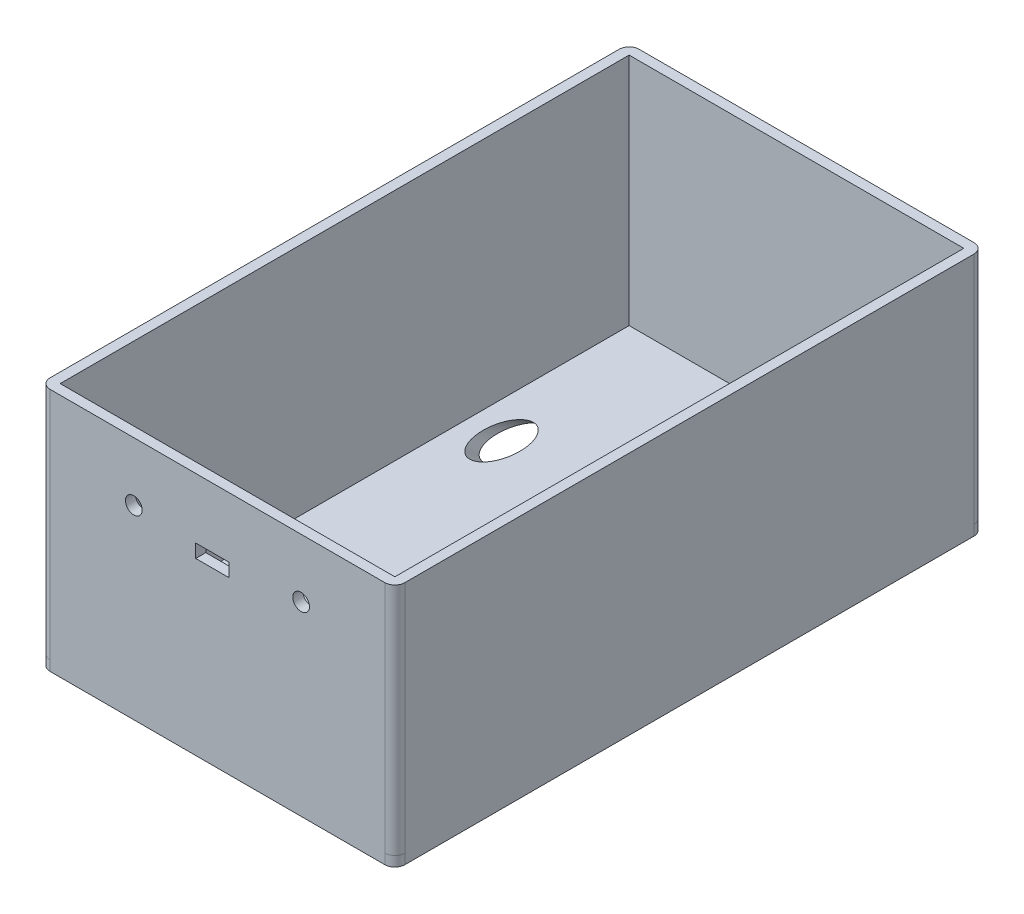
ISO-10303-21;
HEADER;
FILE_DESCRIPTION(('STEP AP214'),'2;1');
FILE_NAME('part.step','',(''),(''),'','','');
FILE_SCHEMA(('AUTOMOTIVE_DESIGN { 1 0 10303 214 1 1 1 1 }'));
ENDSEC;
DATA;
#1=APPLICATION_CONTEXT('core data for automotive mechanical design processes');
#2=APPLICATION_PROTOCOL_DEFINITION('international standard','automotive_design',2000,#1);
#3=PRODUCT_CONTEXT('',#1,'mechanical');
#4=PRODUCT('Part','Part','',(#3));
#5=PRODUCT_RELATED_PRODUCT_CATEGORY('part','',(#4));
#6=PRODUCT_DEFINITION_FORMATION('','',#4);
#7=PRODUCT_DEFINITION_CONTEXT('part definition',#1,'design');
#8=PRODUCT_DEFINITION('design','',#6,#7);
#9=PRODUCT_DEFINITION_SHAPE('','',#8);
#10=(LENGTH_UNIT() NAMED_UNIT(*) SI_UNIT(.MILLI.,.METRE.));
#11=(NAMED_UNIT(*) PLANE_ANGLE_UNIT() SI_UNIT($,.RADIAN.));
#12=(NAMED_UNIT(*) SI_UNIT($,.STERADIAN.) SOLID_ANGLE_UNIT());
#13=UNCERTAINTY_MEASURE_WITH_UNIT(LENGTH_MEASURE(1.E-05),#10,'distance_accuracy_value','');
#14=(GEOMETRIC_REPRESENTATION_CONTEXT(3) GLOBAL_UNCERTAINTY_ASSIGNED_CONTEXT((#13)) GLOBAL_UNIT_ASSIGNED_CONTEXT((#10,
#11,#12)) REPRESENTATION_CONTEXT('',''));
#15=CARTESIAN_POINT('',(0.,0.,0.));
#16=DIRECTION('',(0.,0.,1.));
#17=DIRECTION('',(1.,0.,0.));
#18=AXIS2_PLACEMENT_3D('',#15,#16,#17);
#19=CARTESIAN_POINT('',(0.,70.,0.));
#20=DIRECTION('',(0.,-1.,0.));
#21=DIRECTION('',(0.,0.,-1.));
#22=AXIS2_PLACEMENT_3D('',#19,#20,#21);
#23=PLANE('',#22);
#24=DIRECTION('',(0.,0.,1.));
#25=VECTOR('',#24,1.);
#26=CARTESIAN_POINT('',(-53.,70.,-88.));
#27=LINE('',#26,#25);
#28=CARTESIAN_POINT('',(-53.,70.,-85.));
#29=VERTEX_POINT('',#28);
#30=CARTESIAN_POINT('',(-53.,70.,85.));
#31=VERTEX_POINT('',#30);
#32=EDGE_CURVE('E435',#29,#31,#27,.T.);
#33=ORIENTED_EDGE('',*,*,#32,.T.);
#34=CARTESIAN_POINT('',(-50.,70.,85.));
#35=DIRECTION('',(0.,-1.,0.));
#36=DIRECTION('',(0.,0.,-1.));
#37=AXIS2_PLACEMENT_3D('',#34,#35,#36);
#38=CIRCLE('',#37,3.);
#39=CARTESIAN_POINT('',(-50.,70.,88.));
#40=VERTEX_POINT('',#39);
#41=EDGE_CURVE('E486',#31,#40,#38,.F.);
#42=ORIENTED_EDGE('',*,*,#41,.T.);
#43=DIRECTION('',(1.,0.,0.));
#44=VECTOR('',#43,1.);
#45=CARTESIAN_POINT('',(53.,70.,88.));
#46=LINE('',#45,#44);
#47=CARTESIAN_POINT('',(50.,70.,88.));
#48=VERTEX_POINT('',#47);
#49=EDGE_CURVE('E439',#40,#48,#46,.T.);
#50=ORIENTED_EDGE('',*,*,#49,.T.);
#51=CARTESIAN_POINT('',(50.,70.,85.));
#52=DIRECTION('',(0.,-1.,0.));
#53=DIRECTION('',(0.,0.,-1.));
#54=AXIS2_PLACEMENT_3D('',#51,#52,#53);
#55=CIRCLE('',#54,3.);
#56=CARTESIAN_POINT('',(53.,70.,85.));
#57=VERTEX_POINT('',#56);
#58=EDGE_CURVE('E477',#48,#57,#55,.F.);
#59=ORIENTED_EDGE('',*,*,#58,.T.);
#60=DIRECTION('',(0.,0.,-1.));
#61=VECTOR('',#60,1.);
#62=CARTESIAN_POINT('',(53.,70.,-88.));
#63=LINE('',#62,#61);
#64=CARTESIAN_POINT('',(53.,70.,-85.));
#65=VERTEX_POINT('',#64);
#66=EDGE_CURVE('E443',#57,#65,#63,.T.);
#67=ORIENTED_EDGE('',*,*,#66,.T.);
#68=CARTESIAN_POINT('',(50.,70.,-85.));
#69=DIRECTION('',(0.,-1.,0.));
#70=DIRECTION('',(0.,0.,-1.));
#71=AXIS2_PLACEMENT_3D('',#68,#69,#70);
#72=CIRCLE('',#71,3.);
#73=CARTESIAN_POINT('',(50.,70.,-88.));
#74=VERTEX_POINT('',#73);
#75=EDGE_CURVE('E480',#65,#74,#72,.F.);
#76=ORIENTED_EDGE('',*,*,#75,.T.);
#77=DIRECTION('',(-1.,0.,0.));
#78=VECTOR('',#77,1.);
#79=CARTESIAN_POINT('',(53.,70.,-88.));
#80=LINE('',#79,#78);
#81=CARTESIAN_POINT('',(-50.,70.,-88.));
#82=VERTEX_POINT('',#81);
#83=EDGE_CURVE('E447',#74,#82,#80,.T.);
#84=ORIENTED_EDGE('',*,*,#83,.T.);
#85=CARTESIAN_POINT('',(-50.,70.,-85.));
#86=DIRECTION('',(0.,-1.,0.));
#87=DIRECTION('',(0.,0.,-1.));
#88=AXIS2_PLACEMENT_3D('',#85,#86,#87);
#89=CIRCLE('',#88,3.);
#90=EDGE_CURVE('E483',#82,#29,#89,.F.);
#91=ORIENTED_EDGE('',*,*,#90,.T.);
#92=EDGE_LOOP('',(#33,#42,#50,#59,#67,#76,#84,#91));
#93=FACE_BOUND('',#92,.T.);
#94=DIRECTION('',(0.,0.,1.));
#95=VECTOR('',#94,1.);
#96=CARTESIAN_POINT('',(-50.,70.,-85.));
#97=LINE('',#96,#95);
#98=CARTESIAN_POINT('',(-50.,70.,-85.));
#99=VERTEX_POINT('',#98);
#100=CARTESIAN_POINT('',(-50.,70.,85.));
#101=VERTEX_POINT('',#100);
#102=EDGE_CURVE('E392',#99,#101,#97,.T.);
#103=ORIENTED_EDGE('',*,*,#102,.F.);
#104=DIRECTION('',(-1.,0.,0.));
#105=VECTOR('',#104,1.);
#106=CARTESIAN_POINT('',(50.,70.,-85.));
#107=LINE('',#106,#105);
#108=CARTESIAN_POINT('',(50.,70.,-85.));
#109=VERTEX_POINT('',#108);
#110=EDGE_CURVE('E403',#109,#99,#107,.T.);
#111=ORIENTED_EDGE('',*,*,#110,.F.);
#112=DIRECTION('',(0.,0.,-1.));
#113=VECTOR('',#112,1.);
#114=CARTESIAN_POINT('',(50.,70.,-85.));
#115=LINE('',#114,#113);
#116=CARTESIAN_POINT('',(50.,70.,85.));
#117=VERTEX_POINT('',#116);
#118=EDGE_CURVE('E399',#117,#109,#115,.T.);
#119=ORIENTED_EDGE('',*,*,#118,.F.);
#120=DIRECTION('',(1.,0.,0.));
#121=VECTOR('',#120,1.);
#122=CARTESIAN_POINT('',(50.,70.,85.));
#123=LINE('',#122,#121);
#124=EDGE_CURVE('E395',#101,#117,#123,.T.);
#125=ORIENTED_EDGE('',*,*,#124,.F.);
#126=EDGE_LOOP('',(#103,#111,#119,#125));
#127=FACE_BOUND('',#126,.T.);
#128=ADVANCED_FACE('F39',(#93,#127),#23,.F.);
#129=CARTESIAN_POINT('',(-53.,70.,-88.));
#130=DIRECTION('',(1.,0.,0.));
#131=DIRECTION('',(0.,0.,-1.));
#132=AXIS2_PLACEMENT_3D('',#129,#130,#131);
#133=PLANE('',#132);
#134=DIRECTION('',(0.,-1.,0.));
#135=VECTOR('',#134,1.);
#136=CARTESIAN_POINT('',(-53.,70.,-85.));
#137=LINE('',#136,#135);
#138=CARTESIAN_POINT('',(-53.,0.,-85.));
#139=VERTEX_POINT('',#138);
#140=EDGE_CURVE('E470',#29,#139,#137,.T.);
#141=ORIENTED_EDGE('',*,*,#140,.T.);
#142=DIRECTION('',(0.,1.,0.));
#143=VECTOR('',#142,1.);
#144=CARTESIAN_POINT('',(-53.,70.,-85.));
#145=LINE('',#144,#143);
#146=CARTESIAN_POINT('',(-53.,-3.,-85.));
#147=VERTEX_POINT('',#146);
#148=EDGE_CURVE('E11',#139,#147,#145,.F.);
#149=ORIENTED_EDGE('',*,*,#148,.T.);
#150=DIRECTION('',(0.,0.,-1.));
#151=VECTOR('',#150,1.);
#152=CARTESIAN_POINT('',(-53.,-3.,88.));
#153=LINE('',#152,#151);
#154=CARTESIAN_POINT('',(-53.,-3.,85.));
#155=VERTEX_POINT('',#154);
#156=EDGE_CURVE('E372',#155,#147,#153,.T.);
#157=ORIENTED_EDGE('',*,*,#156,.F.);
#158=DIRECTION('',(0.,1.,0.));
#159=VECTOR('',#158,1.);
#160=CARTESIAN_POINT('',(-53.,70.,85.));
#161=LINE('',#160,#159);
#162=CARTESIAN_POINT('',(-53.,0.,85.));
#163=VERTEX_POINT('',#162);
#164=EDGE_CURVE('E49',#155,#163,#161,.T.);
#165=ORIENTED_EDGE('',*,*,#164,.T.);
#166=DIRECTION('',(0.,-1.,0.));
#167=VECTOR('',#166,1.);
#168=CARTESIAN_POINT('',(-53.,70.,85.));
#169=LINE('',#168,#167);
#170=EDGE_CURVE('E474',#163,#31,#169,.F.);
#171=ORIENTED_EDGE('',*,*,#170,.T.);
#172=ORIENTED_EDGE('',*,*,#32,.F.);
#173=EDGE_LOOP('',(#141,#149,#157,#165,#171,#172));
#174=FACE_BOUND('',#173,.T.);
#175=ADVANCED_FACE('F542',(#174),#133,.F.);
#176=CARTESIAN_POINT('',(53.,70.,88.));
#177=DIRECTION('',(0.,0.,-1.));
#178=DIRECTION('',(-1.,0.,0.));
#179=AXIS2_PLACEMENT_3D('',#176,#177,#178);
#180=PLANE('',#179);
#181=DIRECTION('',(0.,-1.,0.));
#182=VECTOR('',#181,1.);
#183=CARTESIAN_POINT('',(3.5,57.,88.));
#184=LINE('',#183,#182);
#185=CARTESIAN_POINT('',(3.5,52.,88.));
#186=VERTEX_POINT('',#185);
#187=CARTESIAN_POINT('',(3.5,48.,88.));
#188=VERTEX_POINT('',#187);
#189=EDGE_CURVE('E237',#186,#188,#184,.T.);
#190=ORIENTED_EDGE('',*,*,#189,.T.);
#191=DIRECTION('',(-1.,0.,0.));
#192=VECTOR('',#191,1.);
#193=CARTESIAN_POINT('',(6.5,48.,88.));
#194=LINE('',#193,#192);
#195=CARTESIAN_POINT('',(-6.5,48.,88.));
#196=VERTEX_POINT('',#195);
#197=EDGE_CURVE('E244',#188,#196,#194,.T.);
#198=ORIENTED_EDGE('',*,*,#197,.T.);
#199=DIRECTION('',(0.,1.,0.));
#200=VECTOR('',#199,1.);
#201=CARTESIAN_POINT('',(-6.5,48.,88.));
#202=LINE('',#201,#200);
#203=CARTESIAN_POINT('',(-6.5,52.,88.));
#204=VERTEX_POINT('',#203);
#205=EDGE_CURVE('E254',#196,#204,#202,.T.);
#206=ORIENTED_EDGE('',*,*,#205,.T.);
#207=DIRECTION('',(1.,0.,0.));
#208=VECTOR('',#207,1.);
#209=CARTESIAN_POINT('',(-6.5,52.,88.));
#210=LINE('',#209,#208);
#211=EDGE_CURVE('E246',#204,#186,#210,.T.);
#212=ORIENTED_EDGE('',*,*,#211,.T.);
#213=EDGE_LOOP('',(#190,#198,#206,#212));
#214=FACE_BOUND('',#213,.T.);
#215=CARTESIAN_POINT('',(25.,52.5,88.));
#216=DIRECTION('',(0.,0.,-1.));
#217=DIRECTION('',(-1.,0.,0.));
#218=AXIS2_PLACEMENT_3D('',#215,#216,#217);
#219=CIRCLE('',#218,2.5);
#220=CARTESIAN_POINT('',(22.5,52.5,88.));
#221=VERTEX_POINT('',#220);
#222=EDGE_CURVE('E268',#221,#221,#219,.T.);
#223=ORIENTED_EDGE('',*,*,#222,.T.);
#224=EDGE_LOOP('',(#223));
#225=FACE_BOUND('',#224,.T.);
#226=CARTESIAN_POINT('',(-25.,52.5,88.));
#227=DIRECTION('',(0.,0.,-1.));
#228=DIRECTION('',(-1.,0.,0.));
#229=AXIS2_PLACEMENT_3D('',#226,#227,#228);
#230=CIRCLE('',#229,2.5);
#231=CARTESIAN_POINT('',(-27.5,52.5,88.));
#232=VERTEX_POINT('',#231);
#233=EDGE_CURVE('E276',#232,#232,#230,.T.);
#234=ORIENTED_EDGE('',*,*,#233,.T.);
#235=EDGE_LOOP('',(#234));
#236=FACE_BOUND('',#235,.T.);
#237=DIRECTION('',(-1.,0.,0.));
#238=VECTOR('',#237,1.);
#239=CARTESIAN_POINT('',(53.,-3.,88.));
#240=LINE('',#239,#238);
#241=CARTESIAN_POINT('',(50.,-3.,88.));
#242=VERTEX_POINT('',#241);
#243=CARTESIAN_POINT('',(-50.,-3.,88.));
#244=VERTEX_POINT('',#243);
#245=EDGE_CURVE('E387',#242,#244,#240,.T.);
#246=ORIENTED_EDGE('',*,*,#245,.F.);
#247=DIRECTION('',(0.,1.,0.));
#248=VECTOR('',#247,1.);
#249=CARTESIAN_POINT('',(50.,70.,88.));
#250=LINE('',#249,#248);
#251=CARTESIAN_POINT('',(50.,0.,88.));
#252=VERTEX_POINT('',#251);
#253=EDGE_CURVE('E506',#242,#252,#250,.T.);
#254=ORIENTED_EDGE('',*,*,#253,.T.);
#255=DIRECTION('',(0.,-1.,0.));
#256=VECTOR('',#255,1.);
#257=CARTESIAN_POINT('',(50.,70.,88.));
#258=LINE('',#257,#256);
#259=EDGE_CURVE('E451',#252,#48,#258,.F.);
#260=ORIENTED_EDGE('',*,*,#259,.T.);
#261=ORIENTED_EDGE('',*,*,#49,.F.);
#262=DIRECTION('',(0.,-1.,0.));
#263=VECTOR('',#262,1.);
#264=CARTESIAN_POINT('',(-50.,70.,88.));
#265=LINE('',#264,#263);
#266=CARTESIAN_POINT('',(-50.,0.,88.));
#267=VERTEX_POINT('',#266);
#268=EDGE_CURVE('E454',#40,#267,#265,.T.);
#269=ORIENTED_EDGE('',*,*,#268,.T.);
#270=DIRECTION('',(0.,1.,0.));
#271=VECTOR('',#270,1.);
#272=CARTESIAN_POINT('',(-50.,70.,88.));
#273=LINE('',#272,#271);
#274=EDGE_CURVE('E503',#267,#244,#273,.F.);
#275=ORIENTED_EDGE('',*,*,#274,.T.);
#276=EDGE_LOOP('',(#246,#254,#260,#261,#269,#275));
#277=FACE_BOUND('',#276,.T.);
#278=ADVANCED_FACE('F556',(#214,#225,#236,#277),#180,.F.);
#279=CARTESIAN_POINT('',(53.,70.,-88.));
#280=DIRECTION('',(-1.,0.,0.));
#281=DIRECTION('',(0.,0.,1.));
#282=AXIS2_PLACEMENT_3D('',#279,#280,#281);
#283=PLANE('',#282);
#284=DIRECTION('',(0.,-1.,0.));
#285=VECTOR('',#284,1.);
#286=CARTESIAN_POINT('',(53.,70.,85.));
#287=LINE('',#286,#285);
#288=CARTESIAN_POINT('',(53.,0.,85.));
#289=VERTEX_POINT('',#288);
#290=EDGE_CURVE('E496',#57,#289,#287,.T.);
#291=ORIENTED_EDGE('',*,*,#290,.T.);
#292=DIRECTION('',(0.,1.,0.));
#293=VECTOR('',#292,1.);
#294=CARTESIAN_POINT('',(53.,70.,85.));
#295=LINE('',#294,#293);
#296=CARTESIAN_POINT('',(53.,-3.,85.));
#297=VERTEX_POINT('',#296);
#298=EDGE_CURVE('E514',#289,#297,#295,.F.);
#299=ORIENTED_EDGE('',*,*,#298,.T.);
#300=DIRECTION('',(0.,0.,1.));
#301=VECTOR('',#300,1.);
#302=CARTESIAN_POINT('',(53.,-3.,88.));
#303=LINE('',#302,#301);
#304=CARTESIAN_POINT('',(53.,-3.,-85.));
#305=VERTEX_POINT('',#304);
#306=EDGE_CURVE('E383',#305,#297,#303,.T.);
#307=ORIENTED_EDGE('',*,*,#306,.F.);
#308=DIRECTION('',(0.,1.,0.));
#309=VECTOR('',#308,1.);
#310=CARTESIAN_POINT('',(53.,70.,-85.));
#311=LINE('',#310,#309);
#312=CARTESIAN_POINT('',(53.,0.,-85.));
#313=VERTEX_POINT('',#312);
#314=EDGE_CURVE('E510',#305,#313,#311,.T.);
#315=ORIENTED_EDGE('',*,*,#314,.T.);
#316=DIRECTION('',(0.,-1.,0.));
#317=VECTOR('',#316,1.);
#318=CARTESIAN_POINT('',(53.,70.,-85.));
#319=LINE('',#318,#317);
#320=EDGE_CURVE('E500',#313,#65,#319,.F.);
#321=ORIENTED_EDGE('',*,*,#320,.T.);
#322=ORIENTED_EDGE('',*,*,#66,.F.);
#323=EDGE_LOOP('',(#291,#299,#307,#315,#321,#322));
#324=FACE_BOUND('',#323,.T.);
#325=ADVANCED_FACE('F566',(#324),#283,.F.);
#326=CARTESIAN_POINT('',(53.,70.,-88.));
#327=DIRECTION('',(0.,0.,1.));
#328=DIRECTION('',(1.,0.,0.));
#329=AXIS2_PLACEMENT_3D('',#326,#327,#328);
#330=PLANE('',#329);
#331=DIRECTION('',(0.,-1.,0.));
#332=VECTOR('',#331,1.);
#333=CARTESIAN_POINT('',(50.,70.,-88.));
#334=LINE('',#333,#332);
#335=CARTESIAN_POINT('',(50.,0.,-88.));
#336=VERTEX_POINT('',#335);
#337=EDGE_CURVE('E489',#74,#336,#334,.T.);
#338=ORIENTED_EDGE('',*,*,#337,.T.);
#339=DIRECTION('',(0.,1.,0.));
#340=VECTOR('',#339,1.);
#341=CARTESIAN_POINT('',(50.,70.,-88.));
#342=LINE('',#341,#340);
#343=CARTESIAN_POINT('',(50.,-3.,-88.));
#344=VERTEX_POINT('',#343);
#345=EDGE_CURVE('E533',#336,#344,#342,.F.);
#346=ORIENTED_EDGE('',*,*,#345,.T.);
#347=DIRECTION('',(1.,0.,0.));
#348=VECTOR('',#347,1.);
#349=CARTESIAN_POINT('',(53.,-3.,-88.));
#350=LINE('',#349,#348);
#351=CARTESIAN_POINT('',(-50.,-3.,-88.));
#352=VERTEX_POINT('',#351);
#353=EDGE_CURVE('E379',#352,#344,#350,.T.);
#354=ORIENTED_EDGE('',*,*,#353,.F.);
#355=DIRECTION('',(0.,1.,0.));
#356=VECTOR('',#355,1.);
#357=CARTESIAN_POINT('',(-50.,70.,-88.));
#358=LINE('',#357,#356);
#359=CARTESIAN_POINT('',(-50.,0.,-88.));
#360=VERTEX_POINT('',#359);
#361=EDGE_CURVE('E529',#352,#360,#358,.T.);
#362=ORIENTED_EDGE('',*,*,#361,.T.);
#363=DIRECTION('',(0.,-1.,0.));
#364=VECTOR('',#363,1.);
#365=CARTESIAN_POINT('',(-50.,70.,-88.));
#366=LINE('',#365,#364);
#367=EDGE_CURVE('E493',#360,#82,#366,.F.);
#368=ORIENTED_EDGE('',*,*,#367,.T.);
#369=ORIENTED_EDGE('',*,*,#83,.F.);
#370=EDGE_LOOP('',(#338,#346,#354,#362,#368,#369));
#371=FACE_BOUND('',#370,.T.);
#372=ADVANCED_FACE('F577',(#371),#330,.F.);
#373=CARTESIAN_POINT('',(-50.,70.,-85.));
#374=DIRECTION('',(1.,0.,0.));
#375=DIRECTION('',(0.,0.,-1.));
#376=AXIS2_PLACEMENT_3D('',#373,#374,#375);
#377=PLANE('',#376);
#378=DIRECTION('',(0.,0.,1.));
#379=VECTOR('',#378,1.);
#380=CARTESIAN_POINT('',(-50.,0.,-85.));
#381=LINE('',#380,#379);
#382=CARTESIAN_POINT('',(-50.,0.,-85.));
#383=VERTEX_POINT('',#382);
#384=CARTESIAN_POINT('',(-50.,0.,85.));
#385=VERTEX_POINT('',#384);
#386=EDGE_CURVE('E391',#383,#385,#381,.T.);
#387=ORIENTED_EDGE('',*,*,#386,.F.);
#388=DIRECTION('',(0.,-1.,0.));
#389=VECTOR('',#388,1.);
#390=CARTESIAN_POINT('',(-50.,70.,-85.));
#391=LINE('',#390,#389);
#392=EDGE_CURVE('E406',#99,#383,#391,.T.);
#393=ORIENTED_EDGE('',*,*,#392,.F.);
#394=ORIENTED_EDGE('',*,*,#102,.T.);
#395=DIRECTION('',(0.,-1.,0.));
#396=VECTOR('',#395,1.);
#397=CARTESIAN_POINT('',(-50.,70.,85.));
#398=LINE('',#397,#396);
#399=EDGE_CURVE('E431',#101,#385,#398,.T.);
#400=ORIENTED_EDGE('',*,*,#399,.T.);
#401=EDGE_LOOP('',(#387,#393,#394,#400));
#402=FACE_BOUND('',#401,.T.);
#403=ADVANCED_FACE('F614',(#402),#377,.T.);
#404=CARTESIAN_POINT('',(50.,70.,85.));
#405=DIRECTION('',(0.,0.,-1.));
#406=DIRECTION('',(-1.,0.,0.));
#407=AXIS2_PLACEMENT_3D('',#404,#405,#406);
#408=PLANE('',#407);
#409=DIRECTION('',(-1.,0.,0.));
#410=VECTOR('',#409,1.);
#411=CARTESIAN_POINT('',(6.5,48.,85.));
#412=LINE('',#411,#410);
#413=CARTESIAN_POINT('',(3.5,48.,85.));
#414=VERTEX_POINT('',#413);
#415=CARTESIAN_POINT('',(-6.5,48.,85.));
#416=VERTEX_POINT('',#415);
#417=EDGE_CURVE('E242',#414,#416,#412,.T.);
#418=ORIENTED_EDGE('',*,*,#417,.F.);
#419=DIRECTION('',(0.,-1.,0.));
#420=VECTOR('',#419,1.);
#421=CARTESIAN_POINT('',(3.5,57.,85.));
#422=LINE('',#421,#420);
#423=CARTESIAN_POINT('',(3.5,52.,85.));
#424=VERTEX_POINT('',#423);
#425=EDGE_CURVE('E225',#424,#414,#422,.T.);
#426=ORIENTED_EDGE('',*,*,#425,.F.);
#427=DIRECTION('',(1.,0.,0.));
#428=VECTOR('',#427,1.);
#429=CARTESIAN_POINT('',(-6.5,52.,85.));
#430=LINE('',#429,#428);
#431=CARTESIAN_POINT('',(-6.5,52.,85.));
#432=VERTEX_POINT('',#431);
#433=EDGE_CURVE('E949',#432,#424,#430,.T.);
#434=ORIENTED_EDGE('',*,*,#433,.F.);
#435=DIRECTION('',(0.,1.,0.));
#436=VECTOR('',#435,1.);
#437=CARTESIAN_POINT('',(-6.5,48.,85.));
#438=LINE('',#437,#436);
#439=EDGE_CURVE('E252',#416,#432,#438,.T.);
#440=ORIENTED_EDGE('',*,*,#439,.F.);
#441=EDGE_LOOP('',(#418,#426,#434,#440));
#442=FACE_BOUND('',#441,.T.);
#443=CARTESIAN_POINT('',(25.,52.5,85.));
#444=DIRECTION('',(0.,0.,-1.));
#445=DIRECTION('',(-1.,0.,0.));
#446=AXIS2_PLACEMENT_3D('',#443,#444,#445);
#447=CIRCLE('',#446,2.5);
#448=CARTESIAN_POINT('',(22.5,52.5,85.));
#449=VERTEX_POINT('',#448);
#450=EDGE_CURVE('E272',#449,#449,#447,.T.);
#451=ORIENTED_EDGE('',*,*,#450,.F.);
#452=EDGE_LOOP('',(#451));
#453=FACE_BOUND('',#452,.T.);
#454=CARTESIAN_POINT('',(-25.,52.5,85.));
#455=DIRECTION('',(0.,0.,-1.));
#456=DIRECTION('',(-1.,0.,0.));
#457=AXIS2_PLACEMENT_3D('',#454,#455,#456);
#458=CIRCLE('',#457,2.5);
#459=CARTESIAN_POINT('',(-27.5,52.5,85.));
#460=VERTEX_POINT('',#459);
#461=EDGE_CURVE('E267',#460,#460,#458,.T.);
#462=ORIENTED_EDGE('',*,*,#461,.F.);
#463=EDGE_LOOP('',(#462));
#464=FACE_BOUND('',#463,.T.);
#465=DIRECTION('',(1.,0.,0.));
#466=VECTOR('',#465,1.);
#467=CARTESIAN_POINT('',(50.,0.,85.));
#468=LINE('',#467,#466);
#469=CARTESIAN_POINT('',(50.,0.,85.));
#470=VERTEX_POINT('',#469);
#471=EDGE_CURVE('E410',#385,#470,#468,.T.);
#472=ORIENTED_EDGE('',*,*,#471,.F.);
#473=ORIENTED_EDGE('',*,*,#399,.F.);
#474=ORIENTED_EDGE('',*,*,#124,.T.);
#475=DIRECTION('',(0.,-1.,0.));
#476=VECTOR('',#475,1.);
#477=CARTESIAN_POINT('',(50.,70.,85.));
#478=LINE('',#477,#476);
#479=EDGE_CURVE('E428',#117,#470,#478,.T.);
#480=ORIENTED_EDGE('',*,*,#479,.T.);
#481=EDGE_LOOP('',(#472,#473,#474,#480));
#482=FACE_BOUND('',#481,.T.);
#483=ADVANCED_FACE('F249',(#442,#453,#464,#482),#408,.T.);
#484=CARTESIAN_POINT('',(50.,70.,-85.));
#485=DIRECTION('',(-1.,0.,0.));
#486=DIRECTION('',(0.,0.,1.));
#487=AXIS2_PLACEMENT_3D('',#484,#485,#486);
#488=PLANE('',#487);
#489=DIRECTION('',(0.,0.,-1.));
#490=VECTOR('',#489,1.);
#491=CARTESIAN_POINT('',(50.,0.,-85.));
#492=LINE('',#491,#490);
#493=CARTESIAN_POINT('',(50.,0.,-85.));
#494=VERTEX_POINT('',#493);
#495=EDGE_CURVE('E414',#470,#494,#492,.T.);
#496=ORIENTED_EDGE('',*,*,#495,.F.);
#497=ORIENTED_EDGE('',*,*,#479,.F.);
#498=ORIENTED_EDGE('',*,*,#118,.T.);
#499=DIRECTION('',(0.,-1.,0.));
#500=VECTOR('',#499,1.);
#501=CARTESIAN_POINT('',(50.,70.,-85.));
#502=LINE('',#501,#500);
#503=EDGE_CURVE('E424',#109,#494,#502,.T.);
#504=ORIENTED_EDGE('',*,*,#503,.T.);
#505=EDGE_LOOP('',(#496,#497,#498,#504));
#506=FACE_BOUND('',#505,.T.);
#507=ADVANCED_FACE('F812',(#506),#488,.T.);
#508=CARTESIAN_POINT('',(50.,70.,-85.));
#509=DIRECTION('',(0.,0.,1.));
#510=DIRECTION('',(1.,0.,0.));
#511=AXIS2_PLACEMENT_3D('',#508,#509,#510);
#512=PLANE('',#511);
#513=DIRECTION('',(-1.,0.,0.));
#514=VECTOR('',#513,1.);
#515=CARTESIAN_POINT('',(50.,0.,-85.));
#516=LINE('',#515,#514);
#517=EDGE_CURVE('E396',#494,#383,#516,.T.);
#518=ORIENTED_EDGE('',*,*,#517,.F.);
#519=ORIENTED_EDGE('',*,*,#503,.F.);
#520=ORIENTED_EDGE('',*,*,#110,.T.);
#521=ORIENTED_EDGE('',*,*,#392,.T.);
#522=EDGE_LOOP('',(#518,#519,#520,#521));
#523=FACE_BOUND('',#522,.T.);
#524=ADVANCED_FACE('F625',(#523),#512,.T.);
#525=CARTESIAN_POINT('',(-50.,70.,85.));
#526=DIRECTION('',(0.,-1.,0.));
#527=DIRECTION('',(0.,0.,-1.));
#528=AXIS2_PLACEMENT_3D('',#525,#526,#527);
#529=CYLINDRICAL_SURFACE('',#528,3.);
#530=ORIENTED_EDGE('',*,*,#41,.F.);
#531=ORIENTED_EDGE('',*,*,#170,.F.);
#532=CARTESIAN_POINT('',(-50.,0.,85.));
#533=DIRECTION('',(0.,-1.,0.));
#534=DIRECTION('',(0.,0.,-1.));
#535=AXIS2_PLACEMENT_3D('',#532,#533,#534);
#536=CIRCLE('',#535,3.);
#537=EDGE_CURVE('E467',#267,#163,#536,.T.);
#538=ORIENTED_EDGE('',*,*,#537,.F.);
#539=ORIENTED_EDGE('',*,*,#268,.F.);
#540=EDGE_LOOP('',(#530,#531,#538,#539));
#541=FACE_BOUND('',#540,.T.);
#542=ADVANCED_FACE('F548',(#541),#529,.T.);
#543=CARTESIAN_POINT('',(-50.,70.,-85.));
#544=DIRECTION('',(0.,-1.,0.));
#545=DIRECTION('',(0.,0.,-1.));
#546=AXIS2_PLACEMENT_3D('',#543,#544,#545);
#547=CYLINDRICAL_SURFACE('',#546,3.);
#548=ORIENTED_EDGE('',*,*,#90,.F.);
#549=ORIENTED_EDGE('',*,*,#367,.F.);
#550=CARTESIAN_POINT('',(-50.,0.,-85.));
#551=DIRECTION('',(0.,-1.,0.));
#552=DIRECTION('',(0.,0.,-1.));
#553=AXIS2_PLACEMENT_3D('',#550,#551,#552);
#554=CIRCLE('',#553,3.);
#555=EDGE_CURVE('E464',#139,#360,#554,.T.);
#556=ORIENTED_EDGE('',*,*,#555,.F.);
#557=ORIENTED_EDGE('',*,*,#140,.F.);
#558=EDGE_LOOP('',(#548,#549,#556,#557));
#559=FACE_BOUND('',#558,.T.);
#560=ADVANCED_FACE('F583',(#559),#547,.T.);
#561=CARTESIAN_POINT('',(50.,70.,-85.));
#562=DIRECTION('',(0.,-1.,0.));
#563=DIRECTION('',(0.,0.,-1.));
#564=AXIS2_PLACEMENT_3D('',#561,#562,#563);
#565=CYLINDRICAL_SURFACE('',#564,3.);
#566=ORIENTED_EDGE('',*,*,#75,.F.);
#567=ORIENTED_EDGE('',*,*,#320,.F.);
#568=CARTESIAN_POINT('',(50.,0.,-85.));
#569=DIRECTION('',(0.,-1.,0.));
#570=DIRECTION('',(0.,0.,-1.));
#571=AXIS2_PLACEMENT_3D('',#568,#569,#570);
#572=CIRCLE('',#571,3.);
#573=EDGE_CURVE('E461',#336,#313,#572,.T.);
#574=ORIENTED_EDGE('',*,*,#573,.F.);
#575=ORIENTED_EDGE('',*,*,#337,.F.);
#576=EDGE_LOOP('',(#566,#567,#574,#575));
#577=FACE_BOUND('',#576,.T.);
#578=ADVANCED_FACE('F572',(#577),#565,.T.);
#579=CARTESIAN_POINT('',(50.,70.,85.));
#580=DIRECTION('',(0.,-1.,0.));
#581=DIRECTION('',(0.,0.,-1.));
#582=AXIS2_PLACEMENT_3D('',#579,#580,#581);
#583=CYLINDRICAL_SURFACE('',#582,3.);
#584=ORIENTED_EDGE('',*,*,#58,.F.);
#585=ORIENTED_EDGE('',*,*,#259,.F.);
#586=CARTESIAN_POINT('',(50.,0.,85.));
#587=DIRECTION('',(0.,-1.,0.));
#588=DIRECTION('',(0.,0.,-1.));
#589=AXIS2_PLACEMENT_3D('',#586,#587,#588);
#590=CIRCLE('',#589,3.);
#591=EDGE_CURVE('E458',#289,#252,#590,.T.);
#592=ORIENTED_EDGE('',*,*,#591,.F.);
#593=ORIENTED_EDGE('',*,*,#290,.F.);
#594=EDGE_LOOP('',(#584,#585,#592,#593));
#595=FACE_BOUND('',#594,.T.);
#596=ADVANCED_FACE('F561',(#595),#583,.T.);
#597=CARTESIAN_POINT('',(0.,0.,0.));
#598=DIRECTION('',(0.,1.,0.));
#599=DIRECTION('',(0.,0.,1.));
#600=AXIS2_PLACEMENT_3D('',#597,#598,#599);
#601=PLANE('',#600);
#602=CARTESIAN_POINT('',(-39.2636636390506,0.,-36.1311043412954));
#603=DIRECTION('',(0.,1.,0.));
#604=DIRECTION('',(0.,0.,1.));
#605=AXIS2_PLACEMENT_3D('',#602,#603,#604);
#606=ELLIPSE('',#605,9.52340377640062,5.46239999999997);
#607=CARTESIAN_POINT('',(-39.2636636390506,0.,-26.6077005648948));
#608=VERTEX_POINT('',#607);
#609=EDGE_CURVE('E260',#608,#608,#606,.T.);
#610=ORIENTED_EDGE('',*,*,#609,.F.);
#611=EDGE_LOOP('',(#610));
#612=FACE_BOUND('',#611,.T.);
#613=DIRECTION('',(0.,0.,1.));
#614=VECTOR('',#613,1.);
#615=CARTESIAN_POINT('',(-31.9347532475003,0.,50.));
#616=LINE('',#615,#614);
#617=CARTESIAN_POINT('',(-31.9347532475003,0.,50.));
#618=VERTEX_POINT('',#617);
#619=CARTESIAN_POINT('',(-31.9347532475003,0.,70.));
#620=VERTEX_POINT('',#619);
#621=EDGE_CURVE('E56',#618,#620,#616,.T.);
#622=ORIENTED_EDGE('',*,*,#621,.F.);
#623=DIRECTION('',(-1.,0.,0.));
#624=VECTOR('',#623,1.);
#625=CARTESIAN_POINT('',(-28.9347532475003,0.,50.));
#626=LINE('',#625,#624);
#627=CARTESIAN_POINT('',(-28.9347532475003,0.,50.));
#628=VERTEX_POINT('',#627);
#629=EDGE_CURVE('E288',#628,#618,#626,.T.);
#630=ORIENTED_EDGE('',*,*,#629,.F.);
#631=DIRECTION('',(0.,0.,-1.));
#632=VECTOR('',#631,1.);
#633=CARTESIAN_POINT('',(-28.9347532475003,0.,50.));
#634=LINE('',#633,#632);
#635=CARTESIAN_POINT('',(-28.9347532475003,0.,70.));
#636=VERTEX_POINT('',#635);
#637=EDGE_CURVE('E305',#636,#628,#634,.T.);
#638=ORIENTED_EDGE('',*,*,#637,.F.);
#639=DIRECTION('',(1.,0.,0.));
#640=VECTOR('',#639,1.);
#641=CARTESIAN_POINT('',(-28.9347532475003,0.,70.));
#642=LINE('',#641,#640);
#643=EDGE_CURVE('E301',#620,#636,#642,.T.);
#644=ORIENTED_EDGE('',*,*,#643,.F.);
#645=EDGE_LOOP('',(#622,#630,#638,#644));
#646=FACE_BOUND('',#645,.T.);
#647=DIRECTION('',(0.,0.,-1.));
#648=VECTOR('',#647,1.);
#649=CARTESIAN_POINT('',(37.4347532475004,0.,41.));
#650=LINE('',#649,#648);
#651=CARTESIAN_POINT('',(37.4347532475004,0.,79.));
#652=VERTEX_POINT('',#651);
#653=CARTESIAN_POINT('',(37.4347532475004,0.,41.));
#654=VERTEX_POINT('',#653);
#655=EDGE_CURVE('E315',#652,#654,#650,.T.);
#656=ORIENTED_EDGE('',*,*,#655,.F.);
#657=DIRECTION('',(1.,0.,0.));
#658=VECTOR('',#657,1.);
#659=CARTESIAN_POINT('',(23.4347532475004,0.,79.));
#660=LINE('',#659,#658);
#661=CARTESIAN_POINT('',(23.4347532475004,0.,79.));
#662=VERTEX_POINT('',#661);
#663=EDGE_CURVE('E329',#662,#652,#660,.T.);
#664=ORIENTED_EDGE('',*,*,#663,.F.);
#665=DIRECTION('',(0.,0.,1.));
#666=VECTOR('',#665,1.);
#667=CARTESIAN_POINT('',(23.4347532475004,0.,41.));
#668=LINE('',#667,#666);
#669=CARTESIAN_POINT('',(23.4347532475004,0.,41.));
#670=VERTEX_POINT('',#669);
#671=EDGE_CURVE('E348',#670,#662,#668,.T.);
#672=ORIENTED_EDGE('',*,*,#671,.F.);
#673=DIRECTION('',(-1.,0.,0.));
#674=VECTOR('',#673,1.);
#675=CARTESIAN_POINT('',(23.4347532475004,0.,41.));
#676=LINE('',#675,#674);
#677=EDGE_CURVE('E344',#654,#670,#676,.T.);
#678=ORIENTED_EDGE('',*,*,#677,.F.);
#679=EDGE_LOOP('',(#656,#664,#672,#678));
#680=FACE_BOUND('',#679,.T.);
#681=CARTESIAN_POINT('',(0.,0.,60.));
#682=DIRECTION('',(0.,1.,0.));
#683=DIRECTION('',(0.,0.,1.));
#684=AXIS2_PLACEMENT_3D('',#681,#682,#683);
#685=CIRCLE('',#684,10.8695064950007);
#686=CARTESIAN_POINT('',(0.,0.,70.8695064950007));
#687=VERTEX_POINT('',#686);
#688=EDGE_CURVE('E358',#687,#687,#685,.T.);
#689=ORIENTED_EDGE('',*,*,#688,.F.);
#690=EDGE_LOOP('',(#689));
#691=FACE_BOUND('',#690,.T.);
#692=ORIENTED_EDGE('',*,*,#495,.T.);
#693=ORIENTED_EDGE('',*,*,#517,.T.);
#694=ORIENTED_EDGE('',*,*,#386,.T.);
#695=ORIENTED_EDGE('',*,*,#471,.T.);
#696=EDGE_LOOP('',(#692,#693,#694,#695));
#697=FACE_BOUND('',#696,.T.);
#698=ADVANCED_FACE('F632',(#612,#646,#680,#691,#697),#601,.T.);
#699=CARTESIAN_POINT('',(0.,-3.,0.));
#700=DIRECTION('',(0.,1.,0.));
#701=DIRECTION('',(0.,0.,1.));
#702=AXIS2_PLACEMENT_3D('',#699,#700,#701);
#703=PLANE('',#702);
#704=CARTESIAN_POINT('',(-39.2636636390506,-3.,-40.4155483615218));
#705=DIRECTION('',(0.,1.,0.));
#706=DIRECTION('',(0.,0.,1.));
#707=AXIS2_PLACEMENT_3D('',#704,#705,#706);
#708=ELLIPSE('',#707,9.52340377640062,5.46239999999997);
#709=CARTESIAN_POINT('',(-39.2636636390506,-3.,-30.8921445851212));
#710=VERTEX_POINT('',#709);
#711=EDGE_CURVE('E43',#710,#710,#708,.T.);
#712=ORIENTED_EDGE('',*,*,#711,.T.);
#713=EDGE_LOOP('',(#712));
#714=FACE_BOUND('',#713,.T.);
#715=DIRECTION('',(-1.,0.,0.));
#716=VECTOR('',#715,1.);
#717=CARTESIAN_POINT('',(-28.9347532475003,-3.,50.));
#718=LINE('',#717,#716);
#719=CARTESIAN_POINT('',(-28.9347532475003,-3.,50.));
#720=VERTEX_POINT('',#719);
#721=CARTESIAN_POINT('',(-31.9347532475003,-3.,50.));
#722=VERTEX_POINT('',#721);
#723=EDGE_CURVE('E294',#720,#722,#718,.T.);
#724=ORIENTED_EDGE('',*,*,#723,.T.);
#725=DIRECTION('',(0.,0.,1.));
#726=VECTOR('',#725,1.);
#727=CARTESIAN_POINT('',(-31.9347532475003,-3.,50.));
#728=LINE('',#727,#726);
#729=CARTESIAN_POINT('',(-31.9347532475003,-3.,70.));
#730=VERTEX_POINT('',#729);
#731=EDGE_CURVE('E283',#722,#730,#728,.T.);
#732=ORIENTED_EDGE('',*,*,#731,.T.);
#733=DIRECTION('',(1.,0.,0.));
#734=VECTOR('',#733,1.);
#735=CARTESIAN_POINT('',(-28.9347532475003,-3.,70.));
#736=LINE('',#735,#734);
#737=CARTESIAN_POINT('',(-28.9347532475003,-3.,70.));
#738=VERTEX_POINT('',#737);
#739=EDGE_CURVE('E287',#730,#738,#736,.T.);
#740=ORIENTED_EDGE('',*,*,#739,.T.);
#741=DIRECTION('',(0.,0.,-1.));
#742=VECTOR('',#741,1.);
#743=CARTESIAN_POINT('',(-28.9347532475003,-3.,50.));
#744=LINE('',#743,#742);
#745=EDGE_CURVE('E64',#738,#720,#744,.T.);
#746=ORIENTED_EDGE('',*,*,#745,.T.);
#747=EDGE_LOOP('',(#724,#732,#740,#746));
#748=FACE_BOUND('',#747,.T.);
#749=DIRECTION('',(1.,0.,0.));
#750=VECTOR('',#749,1.);
#751=CARTESIAN_POINT('',(23.4347532475004,-3.,79.));
#752=LINE('',#751,#750);
#753=CARTESIAN_POINT('',(23.4347532475004,-3.,79.));
#754=VERTEX_POINT('',#753);
#755=CARTESIAN_POINT('',(37.4347532475004,-3.,79.));
#756=VERTEX_POINT('',#755);
#757=EDGE_CURVE('E337',#754,#756,#752,.T.);
#758=ORIENTED_EDGE('',*,*,#757,.T.);
#759=DIRECTION('',(0.,0.,-1.));
#760=VECTOR('',#759,1.);
#761=CARTESIAN_POINT('',(37.4347532475004,-3.,41.));
#762=LINE('',#761,#760);
#763=CARTESIAN_POINT('',(37.4347532475004,-3.,41.));
#764=VERTEX_POINT('',#763);
#765=EDGE_CURVE('E324',#756,#764,#762,.T.);
#766=ORIENTED_EDGE('',*,*,#765,.T.);
#767=DIRECTION('',(-1.,0.,0.));
#768=VECTOR('',#767,1.);
#769=CARTESIAN_POINT('',(23.4347532475004,-3.,41.));
#770=LINE('',#769,#768);
#771=CARTESIAN_POINT('',(23.4347532475004,-3.,41.));
#772=VERTEX_POINT('',#771);
#773=EDGE_CURVE('E328',#764,#772,#770,.T.);
#774=ORIENTED_EDGE('',*,*,#773,.T.);
#775=DIRECTION('',(0.,0.,1.));
#776=VECTOR('',#775,1.);
#777=CARTESIAN_POINT('',(23.4347532475004,-3.,41.));
#778=LINE('',#777,#776);
#779=EDGE_CURVE('E333',#772,#754,#778,.T.);
#780=ORIENTED_EDGE('',*,*,#779,.T.);
#781=EDGE_LOOP('',(#758,#766,#774,#780));
#782=FACE_BOUND('',#781,.T.);
#783=CARTESIAN_POINT('',(0.,-3.,60.));
#784=DIRECTION('',(0.,1.,0.));
#785=DIRECTION('',(0.,0.,1.));
#786=AXIS2_PLACEMENT_3D('',#783,#784,#785);
#787=CIRCLE('',#786,10.8695064950007);
#788=CARTESIAN_POINT('',(0.,-3.,70.8695064950007));
#789=VERTEX_POINT('',#788);
#790=EDGE_CURVE('E368',#789,#789,#787,.T.);
#791=ORIENTED_EDGE('',*,*,#790,.T.);
#792=EDGE_LOOP('',(#791));
#793=FACE_BOUND('',#792,.T.);
#794=ORIENTED_EDGE('',*,*,#306,.T.);
#795=CARTESIAN_POINT('',(50.,-3.,85.));
#796=DIRECTION('',(0.,1.,0.));
#797=DIRECTION('',(0.,0.,1.));
#798=AXIS2_PLACEMENT_3D('',#795,#796,#797);
#799=CIRCLE('',#798,3.);
#800=EDGE_CURVE('E526',#297,#242,#799,.F.);
#801=ORIENTED_EDGE('',*,*,#800,.T.);
#802=ORIENTED_EDGE('',*,*,#245,.T.);
#803=CARTESIAN_POINT('',(-50.,-3.,85.));
#804=DIRECTION('',(0.,1.,0.));
#805=DIRECTION('',(0.,0.,1.));
#806=AXIS2_PLACEMENT_3D('',#803,#804,#805);
#807=CIRCLE('',#806,3.);
#808=EDGE_CURVE('E517',#244,#155,#807,.F.);
#809=ORIENTED_EDGE('',*,*,#808,.T.);
#810=ORIENTED_EDGE('',*,*,#156,.T.);
#811=CARTESIAN_POINT('',(-50.,-3.,-85.));
#812=DIRECTION('',(0.,1.,0.));
#813=DIRECTION('',(0.,0.,1.));
#814=AXIS2_PLACEMENT_3D('',#811,#812,#813);
#815=CIRCLE('',#814,3.);
#816=EDGE_CURVE('E520',#147,#352,#815,.F.);
#817=ORIENTED_EDGE('',*,*,#816,.T.);
#818=ORIENTED_EDGE('',*,*,#353,.T.);
#819=CARTESIAN_POINT('',(50.,-3.,-85.));
#820=DIRECTION('',(0.,1.,0.));
#821=DIRECTION('',(0.,0.,1.));
#822=AXIS2_PLACEMENT_3D('',#819,#820,#821);
#823=CIRCLE('',#822,3.);
#824=EDGE_CURVE('E523',#344,#305,#823,.F.);
#825=ORIENTED_EDGE('',*,*,#824,.T.);
#826=EDGE_LOOP('',(#794,#801,#802,#809,#810,#817,#818,#825));
#827=FACE_BOUND('',#826,.T.);
#828=ADVANCED_FACE('F590',(#714,#748,#782,#793,#827),#703,.F.);
#829=CARTESIAN_POINT('',(50.,70.,85.));
#830=DIRECTION('',(0.,1.,0.));
#831=DIRECTION('',(0.,0.,1.));
#832=AXIS2_PLACEMENT_3D('',#829,#830,#831);
#833=CYLINDRICAL_SURFACE('',#832,3.);
#834=ORIENTED_EDGE('',*,*,#800,.F.);
#835=ORIENTED_EDGE('',*,*,#298,.F.);
#836=ORIENTED_EDGE('',*,*,#591,.T.);
#837=ORIENTED_EDGE('',*,*,#253,.F.);
#838=EDGE_LOOP('',(#834,#835,#836,#837));
#839=FACE_BOUND('',#838,.T.);
#840=ADVANCED_FACE('F596',(#839),#833,.T.);
#841=CARTESIAN_POINT('',(50.,70.,-85.));
#842=DIRECTION('',(0.,1.,0.));
#843=DIRECTION('',(0.,0.,1.));
#844=AXIS2_PLACEMENT_3D('',#841,#842,#843);
#845=CYLINDRICAL_SURFACE('',#844,3.);
#846=ORIENTED_EDGE('',*,*,#824,.F.);
#847=ORIENTED_EDGE('',*,*,#345,.F.);
#848=ORIENTED_EDGE('',*,*,#573,.T.);
#849=ORIENTED_EDGE('',*,*,#314,.F.);
#850=EDGE_LOOP('',(#846,#847,#848,#849));
#851=FACE_BOUND('',#850,.T.);
#852=ADVANCED_FACE('F593',(#851),#845,.T.);
#853=CARTESIAN_POINT('',(-50.,70.,-85.));
#854=DIRECTION('',(0.,1.,0.));
#855=DIRECTION('',(0.,0.,1.));
#856=AXIS2_PLACEMENT_3D('',#853,#854,#855);
#857=CYLINDRICAL_SURFACE('',#856,3.);
#858=ORIENTED_EDGE('',*,*,#816,.F.);
#859=ORIENTED_EDGE('',*,*,#148,.F.);
#860=ORIENTED_EDGE('',*,*,#555,.T.);
#861=ORIENTED_EDGE('',*,*,#361,.F.);
#862=EDGE_LOOP('',(#858,#859,#860,#861));
#863=FACE_BOUND('',#862,.T.);
#864=ADVANCED_FACE('F588',(#863),#857,.T.);
#865=CARTESIAN_POINT('',(-50.,70.,85.));
#866=DIRECTION('',(0.,1.,0.));
#867=DIRECTION('',(0.,0.,1.));
#868=AXIS2_PLACEMENT_3D('',#865,#866,#867);
#869=CYLINDRICAL_SURFACE('',#868,3.);
#870=ORIENTED_EDGE('',*,*,#808,.F.);
#871=ORIENTED_EDGE('',*,*,#274,.F.);
#872=ORIENTED_EDGE('',*,*,#537,.T.);
#873=ORIENTED_EDGE('',*,*,#164,.F.);
#874=EDGE_LOOP('',(#870,#871,#872,#873));
#875=FACE_BOUND('',#874,.T.);
#876=ADVANCED_FACE('F41',(#875),#869,.T.);
#877=CARTESIAN_POINT('',(0.,-3.,60.));
#878=DIRECTION('',(0.,1.,0.));
#879=DIRECTION('',(0.,0.,1.));
#880=AXIS2_PLACEMENT_3D('',#877,#878,#879);
#881=CYLINDRICAL_SURFACE('',#880,10.8695064950007);
#882=ORIENTED_EDGE('',*,*,#790,.F.);
#883=EDGE_LOOP('',(#882));
#884=FACE_BOUND('',#883,.T.);
#885=ORIENTED_EDGE('',*,*,#688,.T.);
#886=EDGE_LOOP('',(#885));
#887=FACE_BOUND('',#886,.T.);
#888=ADVANCED_FACE('F598',(#884,#887),#881,.F.);
#889=CARTESIAN_POINT('',(37.4347532475004,-3.,41.));
#890=DIRECTION('',(1.,0.,0.));
#891=DIRECTION('',(0.,0.,-1.));
#892=AXIS2_PLACEMENT_3D('',#889,#890,#891);
#893=PLANE('',#892);
#894=ORIENTED_EDGE('',*,*,#655,.T.);
#895=DIRECTION('',(0.,1.,0.));
#896=VECTOR('',#895,1.);
#897=CARTESIAN_POINT('',(37.4347532475004,-3.,41.));
#898=LINE('',#897,#896);
#899=EDGE_CURVE('E341',#764,#654,#898,.T.);
#900=ORIENTED_EDGE('',*,*,#899,.F.);
#901=ORIENTED_EDGE('',*,*,#765,.F.);
#902=DIRECTION('',(0.,1.,0.));
#903=VECTOR('',#902,1.);
#904=CARTESIAN_POINT('',(37.4347532475004,-3.,79.));
#905=LINE('',#904,#903);
#906=EDGE_CURVE('E355',#756,#652,#905,.T.);
#907=ORIENTED_EDGE('',*,*,#906,.T.);
#908=EDGE_LOOP('',(#894,#900,#901,#907));
#909=FACE_BOUND('',#908,.T.);
#910=ADVANCED_FACE('F603',(#909),#893,.F.);
#911=CARTESIAN_POINT('',(23.4347532475004,-3.,79.));
#912=DIRECTION('',(0.,0.,1.));
#913=DIRECTION('',(1.,0.,0.));
#914=AXIS2_PLACEMENT_3D('',#911,#912,#913);
#915=PLANE('',#914);
#916=ORIENTED_EDGE('',*,*,#663,.T.);
#917=ORIENTED_EDGE('',*,*,#906,.F.);
#918=ORIENTED_EDGE('',*,*,#757,.F.);
#919=DIRECTION('',(0.,1.,0.));
#920=VECTOR('',#919,1.);
#921=CARTESIAN_POINT('',(23.4347532475004,-3.,79.));
#922=LINE('',#921,#920);
#923=EDGE_CURVE('E359',#754,#662,#922,.T.);
#924=ORIENTED_EDGE('',*,*,#923,.T.);
#925=EDGE_LOOP('',(#916,#917,#918,#924));
#926=FACE_BOUND('',#925,.T.);
#927=ADVANCED_FACE('F664',(#926),#915,.F.);
#928=CARTESIAN_POINT('',(23.4347532475004,-3.,41.));
#929=DIRECTION('',(-1.,0.,0.));
#930=DIRECTION('',(0.,0.,1.));
#931=AXIS2_PLACEMENT_3D('',#928,#929,#930);
#932=PLANE('',#931);
#933=ORIENTED_EDGE('',*,*,#671,.T.);
#934=ORIENTED_EDGE('',*,*,#923,.F.);
#935=ORIENTED_EDGE('',*,*,#779,.F.);
#936=DIRECTION('',(0.,1.,0.));
#937=VECTOR('',#936,1.);
#938=CARTESIAN_POINT('',(23.4347532475004,-3.,41.));
#939=LINE('',#938,#937);
#940=EDGE_CURVE('E362',#772,#670,#939,.T.);
#941=ORIENTED_EDGE('',*,*,#940,.T.);
#942=EDGE_LOOP('',(#933,#934,#935,#941));
#943=FACE_BOUND('',#942,.T.);
#944=ADVANCED_FACE('F674',(#943),#932,.F.);
#945=CARTESIAN_POINT('',(23.4347532475004,-3.,41.));
#946=DIRECTION('',(0.,0.,-1.));
#947=DIRECTION('',(-1.,0.,0.));
#948=AXIS2_PLACEMENT_3D('',#945,#946,#947);
#949=PLANE('',#948);
#950=ORIENTED_EDGE('',*,*,#677,.T.);
#951=ORIENTED_EDGE('',*,*,#940,.F.);
#952=ORIENTED_EDGE('',*,*,#773,.F.);
#953=ORIENTED_EDGE('',*,*,#899,.T.);
#954=EDGE_LOOP('',(#950,#951,#952,#953));
#955=FACE_BOUND('',#954,.T.);
#956=ADVANCED_FACE('F684',(#955),#949,.F.);
#957=CARTESIAN_POINT('',(-31.9347532475003,-3.,50.));
#958=DIRECTION('',(-1.,0.,0.));
#959=DIRECTION('',(0.,0.,1.));
#960=AXIS2_PLACEMENT_3D('',#957,#958,#959);
#961=PLANE('',#960);
#962=ORIENTED_EDGE('',*,*,#621,.T.);
#963=DIRECTION('',(0.,1.,0.));
#964=VECTOR('',#963,1.);
#965=CARTESIAN_POINT('',(-31.9347532475003,-3.,70.));
#966=LINE('',#965,#964);
#967=EDGE_CURVE('E298',#730,#620,#966,.T.);
#968=ORIENTED_EDGE('',*,*,#967,.F.);
#969=ORIENTED_EDGE('',*,*,#731,.F.);
#970=DIRECTION('',(0.,1.,0.));
#971=VECTOR('',#970,1.);
#972=CARTESIAN_POINT('',(-31.9347532475003,-3.,50.));
#973=LINE('',#972,#971);
#974=EDGE_CURVE('E312',#722,#618,#973,.T.);
#975=ORIENTED_EDGE('',*,*,#974,.T.);
#976=EDGE_LOOP('',(#962,#968,#969,#975));
#977=FACE_BOUND('',#976,.T.);
#978=ADVANCED_FACE('F694',(#977),#961,.F.);
#979=CARTESIAN_POINT('',(-28.9347532475003,-3.,50.));
#980=DIRECTION('',(0.,0.,-1.));
#981=DIRECTION('',(-1.,0.,0.));
#982=AXIS2_PLACEMENT_3D('',#979,#980,#981);
#983=PLANE('',#982);
#984=ORIENTED_EDGE('',*,*,#629,.T.);
#985=ORIENTED_EDGE('',*,*,#974,.F.);
#986=ORIENTED_EDGE('',*,*,#723,.F.);
#987=DIRECTION('',(0.,1.,0.));
#988=VECTOR('',#987,1.);
#989=CARTESIAN_POINT('',(-28.9347532475003,-3.,50.));
#990=LINE('',#989,#988);
#991=EDGE_CURVE('E316',#720,#628,#990,.T.);
#992=ORIENTED_EDGE('',*,*,#991,.T.);
#993=EDGE_LOOP('',(#984,#985,#986,#992));
#994=FACE_BOUND('',#993,.T.);
#995=ADVANCED_FACE('F704',(#994),#983,.F.);
#996=CARTESIAN_POINT('',(-28.9347532475003,-3.,50.));
#997=DIRECTION('',(1.,0.,0.));
#998=DIRECTION('',(0.,0.,-1.));
#999=AXIS2_PLACEMENT_3D('',#996,#997,#998);
#1000=PLANE('',#999);
#1001=ORIENTED_EDGE('',*,*,#637,.T.);
#1002=ORIENTED_EDGE('',*,*,#991,.F.);
#1003=ORIENTED_EDGE('',*,*,#745,.F.);
#1004=DIRECTION('',(0.,1.,0.));
#1005=VECTOR('',#1004,1.);
#1006=CARTESIAN_POINT('',(-28.9347532475003,-3.,70.));
#1007=LINE('',#1006,#1005);
#1008=EDGE_CURVE('E319',#738,#636,#1007,.T.);
#1009=ORIENTED_EDGE('',*,*,#1008,.T.);
#1010=EDGE_LOOP('',(#1001,#1002,#1003,#1009));
#1011=FACE_BOUND('',#1010,.T.);
#1012=ADVANCED_FACE('F713',(#1011),#1000,.F.);
#1013=CARTESIAN_POINT('',(-28.9347532475003,-3.,70.));
#1014=DIRECTION('',(0.,0.,1.));
#1015=DIRECTION('',(1.,0.,0.));
#1016=AXIS2_PLACEMENT_3D('',#1013,#1014,#1015);
#1017=PLANE('',#1016);
#1018=ORIENTED_EDGE('',*,*,#643,.T.);
#1019=ORIENTED_EDGE('',*,*,#1008,.F.);
#1020=ORIENTED_EDGE('',*,*,#739,.F.);
#1021=ORIENTED_EDGE('',*,*,#967,.T.);
#1022=EDGE_LOOP('',(#1018,#1019,#1020,#1021));
#1023=FACE_BOUND('',#1022,.T.);
#1024=ADVANCED_FACE('F723',(#1023),#1017,.F.);
#1025=CARTESIAN_POINT('',(-25.,52.5,88.));
#1026=DIRECTION('',(0.,0.,-1.));
#1027=DIRECTION('',(-1.,0.,0.));
#1028=AXIS2_PLACEMENT_3D('',#1025,#1026,#1027);
#1029=CYLINDRICAL_SURFACE('',#1028,2.5);
#1030=ORIENTED_EDGE('',*,*,#233,.F.);
#1031=EDGE_LOOP('',(#1030));
#1032=FACE_BOUND('',#1031,.T.);
#1033=ORIENTED_EDGE('',*,*,#461,.T.);
#1034=EDGE_LOOP('',(#1033));
#1035=FACE_BOUND('',#1034,.T.);
#1036=ADVANCED_FACE('F732',(#1032,#1035),#1029,.F.);
#1037=CARTESIAN_POINT('',(25.,52.5,88.));
#1038=DIRECTION('',(0.,0.,-1.));
#1039=DIRECTION('',(-1.,0.,0.));
#1040=AXIS2_PLACEMENT_3D('',#1037,#1038,#1039);
#1041=CYLINDRICAL_SURFACE('',#1040,2.5);
#1042=ORIENTED_EDGE('',*,*,#222,.F.);
#1043=EDGE_LOOP('',(#1042));
#1044=FACE_BOUND('',#1043,.T.);
#1045=ORIENTED_EDGE('',*,*,#450,.T.);
#1046=EDGE_LOOP('',(#1045));
#1047=FACE_BOUND('',#1046,.T.);
#1048=ADVANCED_FACE('F742',(#1044,#1047),#1041,.F.);
#1049=CARTESIAN_POINT('',(-6.5,48.,88.));
#1050=DIRECTION('',(-1.,0.,0.));
#1051=DIRECTION('',(0.,0.,1.));
#1052=AXIS2_PLACEMENT_3D('',#1049,#1050,#1051);
#1053=PLANE('',#1052);
#1054=ORIENTED_EDGE('',*,*,#439,.T.);
#1055=DIRECTION('',(0.,0.,1.));
#1056=VECTOR('',#1055,1.);
#1057=CARTESIAN_POINT('',(-6.5,52.,85.));
#1058=LINE('',#1057,#1056);
#1059=EDGE_CURVE('E947',#432,#204,#1058,.T.);
#1060=ORIENTED_EDGE('',*,*,#1059,.T.);
#1061=ORIENTED_EDGE('',*,*,#205,.F.);
#1062=DIRECTION('',(0.,0.,-1.));
#1063=VECTOR('',#1062,1.);
#1064=CARTESIAN_POINT('',(-6.5,48.,88.));
#1065=LINE('',#1064,#1063);
#1066=EDGE_CURVE('E264',#196,#416,#1065,.T.);
#1067=ORIENTED_EDGE('',*,*,#1066,.T.);
#1068=EDGE_LOOP('',(#1054,#1060,#1061,#1067));
#1069=FACE_BOUND('',#1068,.T.);
#1070=ADVANCED_FACE('F752',(#1069),#1053,.F.);
#1071=CARTESIAN_POINT('',(6.5,48.,88.));
#1072=DIRECTION('',(0.,-1.,0.));
#1073=DIRECTION('',(0.,0.,-1.));
#1074=AXIS2_PLACEMENT_3D('',#1071,#1072,#1073);
#1075=PLANE('',#1074);
#1076=ORIENTED_EDGE('',*,*,#197,.F.);
#1077=DIRECTION('',(0.,0.,1.));
#1078=VECTOR('',#1077,1.);
#1079=CARTESIAN_POINT('',(3.5,48.,85.));
#1080=LINE('',#1079,#1078);
#1081=EDGE_CURVE('E228',#414,#188,#1080,.T.);
#1082=ORIENTED_EDGE('',*,*,#1081,.F.);
#1083=ORIENTED_EDGE('',*,*,#417,.T.);
#1084=ORIENTED_EDGE('',*,*,#1066,.F.);
#1085=EDGE_LOOP('',(#1076,#1082,#1083,#1084));
#1086=FACE_BOUND('',#1085,.T.);
#1087=ADVANCED_FACE('F240',(#1086),#1075,.F.);
#1088=CARTESIAN_POINT('',(-39.2636636390506,51.1690389366384,36.945856622974));
#1089=DIRECTION('',(0.,0.573576436351047,0.819152044288991));
#1090=DIRECTION('',(0.,-0.819152044288991,0.573576436351047));
#1091=AXIS2_PLACEMENT_3D('',#1088,#1089,#1090);
#1092=CYLINDRICAL_SURFACE('',#1091,5.46239999999997);
#1093=ORIENTED_EDGE('',*,*,#609,.T.);
#1094=EDGE_LOOP('',(#1093));
#1095=FACE_BOUND('',#1094,.T.);
#1096=ORIENTED_EDGE('',*,*,#711,.F.);
#1097=EDGE_LOOP('',(#1096));
#1098=FACE_BOUND('',#1097,.T.);
#1099=ADVANCED_FACE('F779',(#1095,#1098),#1092,.F.);
#1100=CARTESIAN_POINT('',(-6.5,52.,85.));
#1101=DIRECTION('',(0.,-1.,0.));
#1102=DIRECTION('',(0.,0.,-1.));
#1103=AXIS2_PLACEMENT_3D('',#1100,#1101,#1102);
#1104=PLANE('',#1103);
#1105=ORIENTED_EDGE('',*,*,#211,.F.);
#1106=ORIENTED_EDGE('',*,*,#1059,.F.);
#1107=ORIENTED_EDGE('',*,*,#433,.T.);
#1108=DIRECTION('',(0.,0.,1.));
#1109=VECTOR('',#1108,1.);
#1110=CARTESIAN_POINT('',(3.5,52.,85.));
#1111=LINE('',#1110,#1109);
#1112=EDGE_CURVE('E231',#424,#186,#1111,.T.);
#1113=ORIENTED_EDGE('',*,*,#1112,.T.);
#1114=EDGE_LOOP('',(#1105,#1106,#1107,#1113));
#1115=FACE_BOUND('',#1114,.T.);
#1116=ADVANCED_FACE('F784',(#1115),#1104,.T.);
#1117=CARTESIAN_POINT('',(3.5,57.,85.));
#1118=DIRECTION('',(-1.,0.,0.));
#1119=DIRECTION('',(0.,0.,1.));
#1120=AXIS2_PLACEMENT_3D('',#1117,#1118,#1119);
#1121=PLANE('',#1120);
#1122=ORIENTED_EDGE('',*,*,#189,.F.);
#1123=ORIENTED_EDGE('',*,*,#1112,.F.);
#1124=ORIENTED_EDGE('',*,*,#425,.T.);
#1125=ORIENTED_EDGE('',*,*,#1081,.T.);
#1126=EDGE_LOOP('',(#1122,#1123,#1124,#1125));
#1127=FACE_BOUND('',#1126,.T.);
#1128=ADVANCED_FACE('F227',(#1127),#1121,.T.);
#1129=CLOSED_SHELL('',(#128,#175,#278,#325,#372,#403,#483,#507,#524,#542,#560,#578,#596,#698,
#828,#840,#852,#864,#876,#888,#910,#927,#944,#956,#978,#995,#1012,#1024,#1036,#1048,#1070,#1087,
#1099,#1116,#1128));
#1130=MANIFOLD_SOLID_BREP('B2',#1129);
#1131=ADVANCED_BREP_SHAPE_REPRESENTATION('',(#18,#1130),#14);
#1132=SHAPE_DEFINITION_REPRESENTATION(#9,#1131);
ENDSEC;
END-ISO-10303-21;
